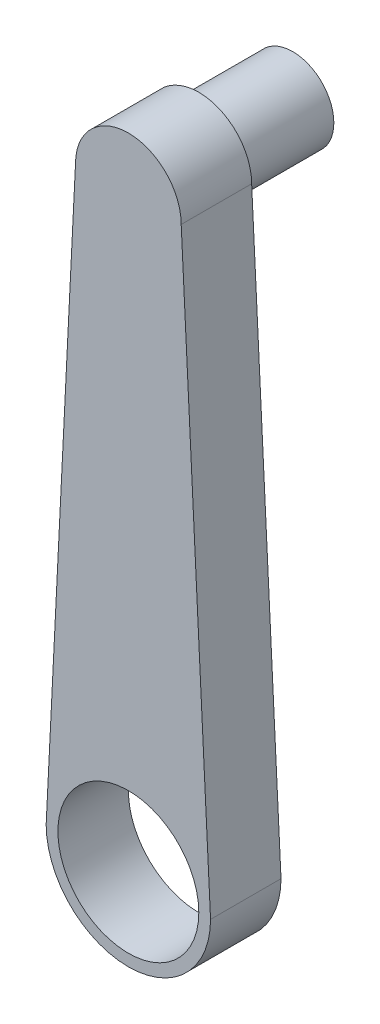
ISO-10303-21;
HEADER;
FILE_DESCRIPTION(('STEP AP214'),'2;1');
FILE_NAME('part.step','',(''),(''),'','','');
FILE_SCHEMA(('AUTOMOTIVE_DESIGN { 1 0 10303 214 1 1 1 1 }'));
ENDSEC;
DATA;
#1=APPLICATION_CONTEXT('core data for automotive mechanical design processes');
#2=APPLICATION_PROTOCOL_DEFINITION('international standard','automotive_design',2000,#1);
#3=PRODUCT_CONTEXT('',#1,'mechanical');
#4=PRODUCT('Part','Part','',(#3));
#5=PRODUCT_RELATED_PRODUCT_CATEGORY('part','',(#4));
#6=PRODUCT_DEFINITION_FORMATION('','',#4);
#7=PRODUCT_DEFINITION_CONTEXT('part definition',#1,'design');
#8=PRODUCT_DEFINITION('design','',#6,#7);
#9=PRODUCT_DEFINITION_SHAPE('','',#8);
#10=(LENGTH_UNIT() NAMED_UNIT(*) SI_UNIT(.MILLI.,.METRE.));
#11=(NAMED_UNIT(*) PLANE_ANGLE_UNIT() SI_UNIT($,.RADIAN.));
#12=(NAMED_UNIT(*) SI_UNIT($,.STERADIAN.) SOLID_ANGLE_UNIT());
#13=UNCERTAINTY_MEASURE_WITH_UNIT(LENGTH_MEASURE(1.E-05),#10,'distance_accuracy_value','');
#14=(GEOMETRIC_REPRESENTATION_CONTEXT(3) GLOBAL_UNCERTAINTY_ASSIGNED_CONTEXT((#13)) GLOBAL_UNIT_ASSIGNED_CONTEXT((#10,
#11,#12)) REPRESENTATION_CONTEXT('',''));
#15=CARTESIAN_POINT('',(0.,0.,0.));
#16=DIRECTION('',(0.,0.,1.));
#17=DIRECTION('',(1.,0.,0.));
#18=AXIS2_PLACEMENT_3D('',#15,#16,#17);
#19=CARTESIAN_POINT('',(69.8254364089776,3.49127182044888,60.));
#20=DIRECTION('',(0.998752338877845,0.0499376169438922,0.));
#21=DIRECTION('',(-0.0499376169438922,0.998752338877845,0.));
#22=AXIS2_PLACEMENT_3D('',#19,#20,#21);
#23=PLANE('',#22);
#24=DIRECTION('',(0.0499376169438922,-0.998752338877845,0.));
#25=VECTOR('',#24,1.);
#26=CARTESIAN_POINT('',(69.8254364089776,3.49127182044888,0.));
#27=LINE('',#26,#25);
#28=CARTESIAN_POINT('',(45.,500.,0.));
#29=VERTEX_POINT('',#28);
#30=CARTESIAN_POINT('',(70.,0.,0.));
#31=VERTEX_POINT('',#30);
#32=EDGE_CURVE('E112',#29,#31,#27,.T.);
#33=ORIENTED_EDGE('',*,*,#32,.F.);
#34=DIRECTION('',(0.,0.,-1.));
#35=VECTOR('',#34,1.);
#36=CARTESIAN_POINT('',(45.,500.,60.));
#37=LINE('',#36,#35);
#38=CARTESIAN_POINT('',(45.,500.,60.));
#39=VERTEX_POINT('',#38);
#40=EDGE_CURVE('E50',#39,#29,#37,.T.);
#41=ORIENTED_EDGE('',*,*,#40,.F.);
#42=DIRECTION('',(0.0499376169438922,-0.998752338877845,0.));
#43=VECTOR('',#42,1.);
#44=CARTESIAN_POINT('',(69.8254364089776,3.49127182044888,60.));
#45=LINE('',#44,#43);
#46=CARTESIAN_POINT('',(70.,0.,60.));
#47=VERTEX_POINT('',#46);
#48=EDGE_CURVE('E91',#39,#47,#45,.T.);
#49=ORIENTED_EDGE('',*,*,#48,.T.);
#50=DIRECTION('',(0.,0.,-1.));
#51=VECTOR('',#50,1.);
#52=CARTESIAN_POINT('',(70.,0.,60.));
#53=LINE('',#52,#51);
#54=EDGE_CURVE('E81',#47,#31,#53,.T.);
#55=ORIENTED_EDGE('',*,*,#54,.T.);
#56=EDGE_LOOP('',(#33,#41,#49,#55));
#57=FACE_BOUND('',#56,.T.);
#58=ADVANCED_FACE('F41',(#57),#23,.T.);
#59=CARTESIAN_POINT('',(0.,500.,60.));
#60=DIRECTION('',(0.,0.,-1.));
#61=DIRECTION('',(-1.,0.,0.));
#62=AXIS2_PLACEMENT_3D('',#59,#60,#61);
#63=CYLINDRICAL_SURFACE('',#62,45.);
#64=CARTESIAN_POINT('',(0.,500.,0.));
#65=DIRECTION('',(0.,0.,1.));
#66=DIRECTION('',(1.,0.,0.));
#67=AXIS2_PLACEMENT_3D('',#64,#65,#66);
#68=CIRCLE('',#67,45.);
#69=CARTESIAN_POINT('',(-45.,500.,0.));
#70=VERTEX_POINT('',#69);
#71=EDGE_CURVE('E99',#29,#70,#68,.T.);
#72=ORIENTED_EDGE('',*,*,#71,.T.);
#73=DIRECTION('',(0.,0.,-1.));
#74=VECTOR('',#73,1.);
#75=CARTESIAN_POINT('',(-45.,500.,60.));
#76=LINE('',#75,#74);
#77=CARTESIAN_POINT('',(-45.,500.,60.));
#78=VERTEX_POINT('',#77);
#79=EDGE_CURVE('E96',#78,#70,#76,.T.);
#80=ORIENTED_EDGE('',*,*,#79,.F.);
#81=CARTESIAN_POINT('',(0.,500.,60.));
#82=DIRECTION('',(0.,0.,1.));
#83=DIRECTION('',(1.,0.,0.));
#84=AXIS2_PLACEMENT_3D('',#81,#82,#83);
#85=CIRCLE('',#84,45.);
#86=EDGE_CURVE('E86',#39,#78,#85,.T.);
#87=ORIENTED_EDGE('',*,*,#86,.F.);
#88=ORIENTED_EDGE('',*,*,#40,.T.);
#89=EDGE_LOOP('',(#72,#80,#87,#88));
#90=FACE_BOUND('',#89,.T.);
#91=ADVANCED_FACE('F97',(#90),#63,.T.);
#92=CARTESIAN_POINT('',(-69.8254364089776,3.49127182044888,60.));
#93=DIRECTION('',(-0.998752338877845,0.0499376169438922,0.));
#94=DIRECTION('',(-0.0499376169438922,-0.998752338877845,0.));
#95=AXIS2_PLACEMENT_3D('',#92,#93,#94);
#96=PLANE('',#95);
#97=DIRECTION('',(0.0499376169438922,0.998752338877845,0.));
#98=VECTOR('',#97,1.);
#99=CARTESIAN_POINT('',(-69.8254364089776,3.49127182044888,0.));
#100=LINE('',#99,#98);
#101=CARTESIAN_POINT('',(-70.,0.,0.));
#102=VERTEX_POINT('',#101);
#103=EDGE_CURVE('E119',#102,#70,#100,.T.);
#104=ORIENTED_EDGE('',*,*,#103,.F.);
#105=DIRECTION('',(0.,0.,-1.));
#106=VECTOR('',#105,1.);
#107=CARTESIAN_POINT('',(-70.,0.,60.));
#108=LINE('',#107,#106);
#109=CARTESIAN_POINT('',(-70.,0.,60.));
#110=VERTEX_POINT('',#109);
#111=EDGE_CURVE('E74',#110,#102,#108,.T.);
#112=ORIENTED_EDGE('',*,*,#111,.F.);
#113=DIRECTION('',(0.0499376169438922,0.998752338877845,0.));
#114=VECTOR('',#113,1.);
#115=CARTESIAN_POINT('',(-69.8254364089776,3.49127182044888,60.));
#116=LINE('',#115,#114);
#117=EDGE_CURVE('E90',#110,#78,#116,.T.);
#118=ORIENTED_EDGE('',*,*,#117,.T.);
#119=ORIENTED_EDGE('',*,*,#79,.T.);
#120=EDGE_LOOP('',(#104,#112,#118,#119));
#121=FACE_BOUND('',#120,.T.);
#122=ADVANCED_FACE('F105',(#121),#96,.T.);
#123=CARTESIAN_POINT('',(0.,0.,60.));
#124=DIRECTION('',(0.,0.,-1.));
#125=DIRECTION('',(-1.,0.,0.));
#126=AXIS2_PLACEMENT_3D('',#123,#124,#125);
#127=CYLINDRICAL_SURFACE('',#126,70.);
#128=CARTESIAN_POINT('',(0.,0.,0.));
#129=DIRECTION('',(0.,0.,1.));
#130=DIRECTION('',(1.,0.,0.));
#131=AXIS2_PLACEMENT_3D('',#128,#129,#130);
#132=CIRCLE('',#131,70.);
#133=EDGE_CURVE('E122',#102,#31,#132,.T.);
#134=ORIENTED_EDGE('',*,*,#133,.T.);
#135=ORIENTED_EDGE('',*,*,#54,.F.);
#136=CARTESIAN_POINT('',(0.,0.,60.));
#137=DIRECTION('',(0.,0.,1.));
#138=DIRECTION('',(1.,0.,0.));
#139=AXIS2_PLACEMENT_3D('',#136,#137,#138);
#140=CIRCLE('',#139,70.);
#141=EDGE_CURVE('E58',#110,#47,#140,.T.);
#142=ORIENTED_EDGE('',*,*,#141,.F.);
#143=ORIENTED_EDGE('',*,*,#111,.T.);
#144=EDGE_LOOP('',(#134,#135,#142,#143));
#145=FACE_BOUND('',#144,.T.);
#146=ADVANCED_FACE('F138',(#145),#127,.T.);
#147=CARTESIAN_POINT('',(0.,0.,60.));
#148=DIRECTION('',(0.,0.,1.));
#149=DIRECTION('',(1.,0.,0.));
#150=AXIS2_PLACEMENT_3D('',#147,#148,#149);
#151=PLANE('',#150);
#152=CARTESIAN_POINT('',(0.,0.,60.));
#153=DIRECTION('',(0.,0.,1.));
#154=DIRECTION('',(1.,0.,0.));
#155=AXIS2_PLACEMENT_3D('',#152,#153,#154);
#156=CIRCLE('',#155,60.);
#157=CARTESIAN_POINT('',(60.,0.,60.));
#158=VERTEX_POINT('',#157);
#159=EDGE_CURVE('E166',#158,#158,#156,.T.);
#160=ORIENTED_EDGE('',*,*,#159,.F.);
#161=EDGE_LOOP('',(#160));
#162=FACE_BOUND('',#161,.T.);
#163=ORIENTED_EDGE('',*,*,#48,.F.);
#164=ORIENTED_EDGE('',*,*,#86,.T.);
#165=ORIENTED_EDGE('',*,*,#117,.F.);
#166=ORIENTED_EDGE('',*,*,#141,.T.);
#167=EDGE_LOOP('',(#163,#164,#165,#166));
#168=FACE_BOUND('',#167,.T.);
#169=ADVANCED_FACE('F88',(#162,#168),#151,.T.);
#170=CARTESIAN_POINT('',(0.,0.,0.));
#171=DIRECTION('',(0.,0.,1.));
#172=DIRECTION('',(1.,0.,0.));
#173=AXIS2_PLACEMENT_3D('',#170,#171,#172);
#174=PLANE('',#173);
#175=CARTESIAN_POINT('',(0.,500.,0.));
#176=DIRECTION('',(0.,0.,1.));
#177=DIRECTION('',(1.,0.,0.));
#178=AXIS2_PLACEMENT_3D('',#175,#176,#177);
#179=CIRCLE('',#178,35.);
#180=CARTESIAN_POINT('',(35.,500.,0.));
#181=VERTEX_POINT('',#180);
#182=EDGE_CURVE('E11',#181,#181,#179,.F.);
#183=ORIENTED_EDGE('',*,*,#182,.F.);
#184=EDGE_LOOP('',(#183));
#185=FACE_BOUND('',#184,.T.);
#186=CARTESIAN_POINT('',(0.,0.,0.));
#187=DIRECTION('',(0.,0.,1.));
#188=DIRECTION('',(1.,0.,0.));
#189=AXIS2_PLACEMENT_3D('',#186,#187,#188);
#190=CIRCLE('',#189,60.);
#191=CARTESIAN_POINT('',(60.,0.,0.));
#192=VERTEX_POINT('',#191);
#193=EDGE_CURVE('E116',#192,#192,#190,.T.);
#194=ORIENTED_EDGE('',*,*,#193,.T.);
#195=EDGE_LOOP('',(#194));
#196=FACE_BOUND('',#195,.T.);
#197=ORIENTED_EDGE('',*,*,#32,.T.);
#198=ORIENTED_EDGE('',*,*,#133,.F.);
#199=ORIENTED_EDGE('',*,*,#103,.T.);
#200=ORIENTED_EDGE('',*,*,#71,.F.);
#201=EDGE_LOOP('',(#197,#198,#199,#200));
#202=FACE_BOUND('',#201,.T.);
#203=ADVANCED_FACE('F130',(#185,#196,#202),#174,.F.);
#204=CARTESIAN_POINT('',(0.,0.,0.));
#205=DIRECTION('',(0.,0.,1.));
#206=DIRECTION('',(1.,0.,0.));
#207=AXIS2_PLACEMENT_3D('',#204,#205,#206);
#208=CYLINDRICAL_SURFACE('',#207,60.);
#209=ORIENTED_EDGE('',*,*,#193,.F.);
#210=EDGE_LOOP('',(#209));
#211=FACE_BOUND('',#210,.T.);
#212=ORIENTED_EDGE('',*,*,#159,.T.);
#213=EDGE_LOOP('',(#212));
#214=FACE_BOUND('',#213,.T.);
#215=ADVANCED_FACE('F145',(#211,#214),#208,.F.);
#216=CARTESIAN_POINT('',(0.,500.,-80.));
#217=DIRECTION('',(0.,0.,1.));
#218=DIRECTION('',(1.,0.,0.));
#219=AXIS2_PLACEMENT_3D('',#216,#217,#218);
#220=CYLINDRICAL_SURFACE('',#219,35.);
#221=CARTESIAN_POINT('',(0.,500.,-80.));
#222=DIRECTION('',(0.,0.,-1.));
#223=DIRECTION('',(-1.,0.,0.));
#224=AXIS2_PLACEMENT_3D('',#221,#222,#223);
#225=CIRCLE('',#224,35.);
#226=CARTESIAN_POINT('',(-35.,500.,-80.));
#227=VERTEX_POINT('',#226);
#228=EDGE_CURVE('E164',#227,#227,#225,.T.);
#229=ORIENTED_EDGE('',*,*,#228,.F.);
#230=EDGE_LOOP('',(#229));
#231=FACE_BOUND('',#230,.T.);
#232=ORIENTED_EDGE('',*,*,#182,.T.);
#233=EDGE_LOOP('',(#232));
#234=FACE_BOUND('',#233,.T.);
#235=ADVANCED_FACE('F152',(#231,#234),#220,.T.);
#236=CARTESIAN_POINT('',(0.,500.,-80.));
#237=DIRECTION('',(0.,0.,-1.));
#238=DIRECTION('',(-1.,0.,0.));
#239=AXIS2_PLACEMENT_3D('',#236,#237,#238);
#240=PLANE('',#239);
#241=ORIENTED_EDGE('',*,*,#228,.T.);
#242=EDGE_LOOP('',(#241));
#243=FACE_BOUND('',#242,.T.);
#244=ADVANCED_FACE('F156',(#243),#240,.T.);
#245=CLOSED_SHELL('',(#58,#91,#122,#146,#169,#203,#215,#235,#244));
#246=MANIFOLD_SOLID_BREP('B2',#245);
#247=ADVANCED_BREP_SHAPE_REPRESENTATION('',(#18,#246),#14);
#248=SHAPE_DEFINITION_REPRESENTATION(#9,#247);
ENDSEC;
END-ISO-10303-21;
